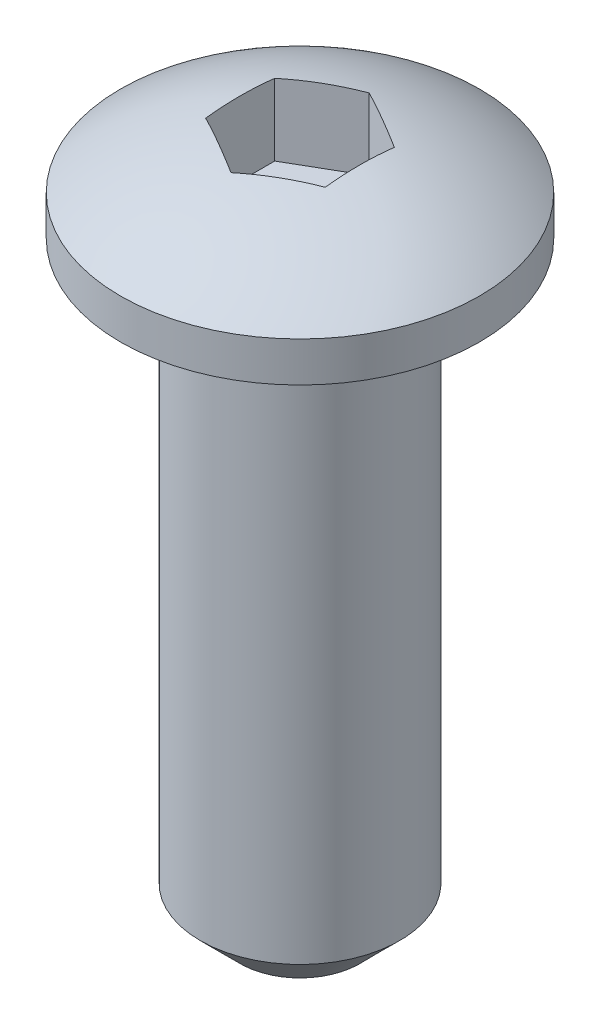
ISO-10303-21;
HEADER;
FILE_DESCRIPTION(('STEP AP214'),'2;1');
FILE_NAME('part.step','',(''),(''),'','','');
FILE_SCHEMA(('AUTOMOTIVE_DESIGN { 1 0 10303 214 1 1 1 1 }'));
ENDSEC;
DATA;
#1=APPLICATION_CONTEXT('core data for automotive mechanical design processes');
#2=APPLICATION_PROTOCOL_DEFINITION('international standard','automotive_design',2000,#1);
#3=PRODUCT_CONTEXT('',#1,'mechanical');
#4=PRODUCT('Part','Part','',(#3));
#5=PRODUCT_RELATED_PRODUCT_CATEGORY('part','',(#4));
#6=PRODUCT_DEFINITION_FORMATION('','',#4);
#7=PRODUCT_DEFINITION_CONTEXT('part definition',#1,'design');
#8=PRODUCT_DEFINITION('design','',#6,#7);
#9=PRODUCT_DEFINITION_SHAPE('','',#8);
#10=(LENGTH_UNIT() NAMED_UNIT(*) SI_UNIT(.MILLI.,.METRE.));
#11=(NAMED_UNIT(*) PLANE_ANGLE_UNIT() SI_UNIT($,.RADIAN.));
#12=(NAMED_UNIT(*) SI_UNIT($,.STERADIAN.) SOLID_ANGLE_UNIT());
#13=UNCERTAINTY_MEASURE_WITH_UNIT(LENGTH_MEASURE(1.E-05),#10,'distance_accuracy_value','');
#14=(GEOMETRIC_REPRESENTATION_CONTEXT(3) GLOBAL_UNCERTAINTY_ASSIGNED_CONTEXT((#13)) GLOBAL_UNIT_ASSIGNED_CONTEXT((#10,
#11,#12)) REPRESENTATION_CONTEXT('',''));
#15=CARTESIAN_POINT('',(0.,0.,0.));
#16=DIRECTION('',(0.,0.,1.));
#17=DIRECTION('',(1.,0.,0.));
#18=AXIS2_PLACEMENT_3D('',#15,#16,#17);
#19=CARTESIAN_POINT('',(0.,-5.,0.));
#20=DIRECTION('',(0.,1.,0.));
#21=DIRECTION('',(-1.,0.,0.));
#22=AXIS2_PLACEMENT_3D('',#19,#20,#21);
#23=SPHERICAL_SURFACE('',#22,7.5);
#24=CARTESIAN_POINT('',(0.,1.,0.));
#25=DIRECTION('',(0.,1.,0.));
#26=DIRECTION('',(0.,0.,1.));
#27=AXIS2_PLACEMENT_3D('',#24,#25,#26);
#28=CIRCLE('',#27,4.5);
#29=CARTESIAN_POINT('',(0.,1.,4.5));
#30=VERTEX_POINT('',#29);
#31=EDGE_CURVE('E128',#30,#30,#28,.T.);
#32=ORIENTED_EDGE('',*,*,#31,.T.);
#33=EDGE_LOOP('',(#32));
#34=FACE_BOUND('',#33,.T.);
#35=CARTESIAN_POINT('',(-0.749999999999999,-5.,-1.29903810567666));
#36=DIRECTION('',(0.5,0.,0.866025403784439));
#37=DIRECTION('',(0.866025403784439,0.,-0.5));
#38=AXIS2_PLACEMENT_3D('',#35,#36,#37);
#39=CIRCLE('',#38,7.34846922834954);
#40=CARTESIAN_POINT('',(-1.5,2.29725975966321,-0.866025403784439));
#41=VERTEX_POINT('',#40);
#42=CARTESIAN_POINT('',(0.,2.29725975966321,-1.73205080756888));
#43=VERTEX_POINT('',#42);
#44=EDGE_CURVE('E143',#41,#43,#39,.F.);
#45=ORIENTED_EDGE('',*,*,#44,.T.);
#46=CARTESIAN_POINT('',(0.750000000000002,-5.,-1.29903810567666));
#47=DIRECTION('',(-0.5,0.,0.866025403784438));
#48=DIRECTION('',(0.866025403784439,0.,0.5));
#49=AXIS2_PLACEMENT_3D('',#46,#47,#48);
#50=CIRCLE('',#49,7.34846922834954);
#51=CARTESIAN_POINT('',(1.5,2.29725975966321,-0.866025403784439));
#52=VERTEX_POINT('',#51);
#53=EDGE_CURVE('E54',#43,#52,#50,.F.);
#54=ORIENTED_EDGE('',*,*,#53,.T.);
#55=CARTESIAN_POINT('',(1.5,-5.,0.));
#56=DIRECTION('',(-1.,0.,0.));
#57=DIRECTION('',(0.,0.,1.));
#58=AXIS2_PLACEMENT_3D('',#55,#56,#57);
#59=CIRCLE('',#58,7.34846922834954);
#60=CARTESIAN_POINT('',(1.5,2.29725975966321,0.86602540378444));
#61=VERTEX_POINT('',#60);
#62=EDGE_CURVE('E131',#52,#61,#59,.F.);
#63=ORIENTED_EDGE('',*,*,#62,.T.);
#64=CARTESIAN_POINT('',(0.750000000000002,-5.,1.29903810567666));
#65=DIRECTION('',(-0.5,0.,-0.866025403784439));
#66=DIRECTION('',(-0.866025403784439,0.,0.5));
#67=AXIS2_PLACEMENT_3D('',#64,#65,#66);
#68=CIRCLE('',#67,7.34846922834954);
#69=CARTESIAN_POINT('',(0.,2.29725975966321,1.73205080756888));
#70=VERTEX_POINT('',#69);
#71=EDGE_CURVE('E134',#61,#70,#68,.F.);
#72=ORIENTED_EDGE('',*,*,#71,.T.);
#73=CARTESIAN_POINT('',(-0.749999999999998,-5.,1.29903810567666));
#74=DIRECTION('',(0.5,0.,-0.866025403784439));
#75=DIRECTION('',(-0.866025403784439,0.,-0.5));
#76=AXIS2_PLACEMENT_3D('',#73,#74,#75);
#77=CIRCLE('',#76,7.34846922834954);
#78=CARTESIAN_POINT('',(-1.5,2.29725975966321,0.866025403784438));
#79=VERTEX_POINT('',#78);
#80=EDGE_CURVE('E137',#70,#79,#77,.F.);
#81=ORIENTED_EDGE('',*,*,#80,.T.);
#82=CARTESIAN_POINT('',(-1.5,-5.,0.));
#83=DIRECTION('',(1.,0.,0.));
#84=DIRECTION('',(0.,0.,-1.));
#85=AXIS2_PLACEMENT_3D('',#82,#83,#84);
#86=CIRCLE('',#85,7.34846922834954);
#87=EDGE_CURVE('E140',#79,#41,#86,.F.);
#88=ORIENTED_EDGE('',*,*,#87,.T.);
#89=EDGE_LOOP('',(#45,#54,#63,#72,#81,#88));
#90=FACE_BOUND('',#89,.T.);
#91=ADVANCED_FACE('F31',(#34,#90),#23,.T.);
#92=CARTESIAN_POINT('',(0.,-15.,0.));
#93=DIRECTION('',(0.,-1.,0.));
#94=DIRECTION('',(0.,0.,-1.));
#95=AXIS2_PLACEMENT_3D('',#92,#93,#94);
#96=PLANE('',#95);
#97=CARTESIAN_POINT('',(0.,-15.,0.));
#98=DIRECTION('',(0.,-1.,0.));
#99=DIRECTION('',(0.,0.,-1.));
#100=AXIS2_PLACEMENT_3D('',#97,#98,#99);
#101=CIRCLE('',#100,1.49999999999999);
#102=CARTESIAN_POINT('',(0.,-15.,-1.49999999999999));
#103=VERTEX_POINT('',#102);
#104=EDGE_CURVE('E11',#103,#103,#101,.T.);
#105=ORIENTED_EDGE('',*,*,#104,.T.);
#106=EDGE_LOOP('',(#105));
#107=FACE_BOUND('',#106,.T.);
#108=ADVANCED_FACE('F33',(#107),#96,.T.);
#109=CARTESIAN_POINT('',(0.,16.1829805996473,0.));
#110=DIRECTION('',(0.,1.,0.));
#111=DIRECTION('',(0.,0.,1.));
#112=AXIS2_PLACEMENT_3D('',#109,#110,#111);
#113=CYLINDRICAL_SURFACE('',#112,4.5);
#114=CARTESIAN_POINT('',(0.,0.,0.));
#115=DIRECTION('',(0.,1.,0.));
#116=DIRECTION('',(0.,0.,1.));
#117=AXIS2_PLACEMENT_3D('',#114,#115,#116);
#118=CIRCLE('',#117,4.5);
#119=CARTESIAN_POINT('',(0.,0.,4.5));
#120=VERTEX_POINT('',#119);
#121=EDGE_CURVE('E125',#120,#120,#118,.T.);
#122=ORIENTED_EDGE('',*,*,#121,.T.);
#123=EDGE_LOOP('',(#122));
#124=FACE_BOUND('',#123,.T.);
#125=ORIENTED_EDGE('',*,*,#31,.F.);
#126=EDGE_LOOP('',(#125));
#127=FACE_BOUND('',#126,.T.);
#128=ADVANCED_FACE('F169',(#124,#127),#113,.T.);
#129=CARTESIAN_POINT('',(-2.5,0.,0.));
#130=DIRECTION('',(0.,-1.,0.));
#131=DIRECTION('',(0.,0.,-1.));
#132=AXIS2_PLACEMENT_3D('',#129,#130,#131);
#133=PLANE('',#132);
#134=CARTESIAN_POINT('',(0.,0.,0.));
#135=DIRECTION('',(0.,1.,0.));
#136=DIRECTION('',(0.,0.,1.));
#137=AXIS2_PLACEMENT_3D('',#134,#135,#136);
#138=CIRCLE('',#137,2.5);
#139=CARTESIAN_POINT('',(0.,0.,2.5));
#140=VERTEX_POINT('',#139);
#141=EDGE_CURVE('E90',#140,#140,#138,.T.);
#142=ORIENTED_EDGE('',*,*,#141,.T.);
#143=EDGE_LOOP('',(#142));
#144=FACE_BOUND('',#143,.T.);
#145=ORIENTED_EDGE('',*,*,#121,.F.);
#146=EDGE_LOOP('',(#145));
#147=FACE_BOUND('',#146,.T.);
#148=ADVANCED_FACE('F175',(#144,#147),#133,.T.);
#149=CARTESIAN_POINT('',(0.,16.1829805996473,0.));
#150=DIRECTION('',(0.,1.,0.));
#151=DIRECTION('',(0.,0.,1.));
#152=AXIS2_PLACEMENT_3D('',#149,#150,#151);
#153=CYLINDRICAL_SURFACE('',#152,2.5);
#154=CARTESIAN_POINT('',(0.,-14.,0.));
#155=DIRECTION('',(0.,-1.,0.));
#156=DIRECTION('',(0.,0.,-1.));
#157=AXIS2_PLACEMENT_3D('',#154,#155,#156);
#158=CIRCLE('',#157,2.5);
#159=CARTESIAN_POINT('',(0.,-14.,-2.5));
#160=VERTEX_POINT('',#159);
#161=EDGE_CURVE('E39',#160,#160,#158,.F.);
#162=ORIENTED_EDGE('',*,*,#161,.T.);
#163=EDGE_LOOP('',(#162));
#164=FACE_BOUND('',#163,.T.);
#165=ORIENTED_EDGE('',*,*,#141,.F.);
#166=EDGE_LOOP('',(#165));
#167=FACE_BOUND('',#166,.T.);
#168=ADVANCED_FACE('F148',(#164,#167),#153,.T.);
#169=CARTESIAN_POINT('',(1.5,2.5,-0.866025403784439));
#170=DIRECTION('',(-0.5,0.,0.866025403784438));
#171=DIRECTION('',(0.866025403784439,0.,0.5));
#172=AXIS2_PLACEMENT_3D('',#169,#170,#171);
#173=PLANE('',#172);
#174=DIRECTION('',(0.,-1.,0.));
#175=VECTOR('',#174,1.);
#176=CARTESIAN_POINT('',(0.,2.5,-1.73205080756888));
#177=LINE('',#176,#175);
#178=CARTESIAN_POINT('',(0.,0.5,-1.73205080756888));
#179=VERTEX_POINT('',#178);
#180=EDGE_CURVE('E83',#43,#179,#177,.T.);
#181=ORIENTED_EDGE('',*,*,#180,.T.);
#182=DIRECTION('',(-0.866025403784439,0.,-0.5));
#183=VECTOR('',#182,1.);
#184=CARTESIAN_POINT('',(1.5,0.5,-0.866025403784439));
#185=LINE('',#184,#183);
#186=CARTESIAN_POINT('',(1.5,0.5,-0.866025403784439));
#187=VERTEX_POINT('',#186);
#188=EDGE_CURVE('E87',#187,#179,#185,.T.);
#189=ORIENTED_EDGE('',*,*,#188,.F.);
#190=DIRECTION('',(0.,-1.,0.));
#191=VECTOR('',#190,1.);
#192=CARTESIAN_POINT('',(1.5,2.5,-0.866025403784439));
#193=LINE('',#192,#191);
#194=EDGE_CURVE('E115',#52,#187,#193,.T.);
#195=ORIENTED_EDGE('',*,*,#194,.F.);
#196=ORIENTED_EDGE('',*,*,#53,.F.);
#197=EDGE_LOOP('',(#181,#189,#195,#196));
#198=FACE_BOUND('',#197,.T.);
#199=ADVANCED_FACE('F85',(#198),#173,.T.);
#200=CARTESIAN_POINT('',(0.,2.5,-1.73205080756888));
#201=DIRECTION('',(0.5,0.,0.866025403784439));
#202=DIRECTION('',(0.866025403784439,0.,-0.5));
#203=AXIS2_PLACEMENT_3D('',#200,#201,#202);
#204=PLANE('',#203);
#205=DIRECTION('',(0.,-1.,0.));
#206=VECTOR('',#205,1.);
#207=CARTESIAN_POINT('',(-1.5,2.5,-0.866025403784439));
#208=LINE('',#207,#206);
#209=CARTESIAN_POINT('',(-1.5,0.5,-0.866025403784439));
#210=VERTEX_POINT('',#209);
#211=EDGE_CURVE('E91',#41,#210,#208,.T.);
#212=ORIENTED_EDGE('',*,*,#211,.T.);
#213=DIRECTION('',(-0.866025403784439,0.,0.5));
#214=VECTOR('',#213,1.);
#215=CARTESIAN_POINT('',(0.,0.5,-1.73205080756888));
#216=LINE('',#215,#214);
#217=EDGE_CURVE('E94',#179,#210,#216,.T.);
#218=ORIENTED_EDGE('',*,*,#217,.F.);
#219=ORIENTED_EDGE('',*,*,#180,.F.);
#220=ORIENTED_EDGE('',*,*,#44,.F.);
#221=EDGE_LOOP('',(#212,#218,#219,#220));
#222=FACE_BOUND('',#221,.T.);
#223=ADVANCED_FACE('F95',(#222),#204,.T.);
#224=CARTESIAN_POINT('',(-1.5,2.5,-0.866025403784439));
#225=DIRECTION('',(1.,0.,0.));
#226=DIRECTION('',(0.,0.,-1.));
#227=AXIS2_PLACEMENT_3D('',#224,#225,#226);
#228=PLANE('',#227);
#229=DIRECTION('',(0.,-1.,0.));
#230=VECTOR('',#229,1.);
#231=CARTESIAN_POINT('',(-1.5,2.5,0.866025403784438));
#232=LINE('',#231,#230);
#233=CARTESIAN_POINT('',(-1.5,0.5,0.866025403784438));
#234=VERTEX_POINT('',#233);
#235=EDGE_CURVE('E120',#79,#234,#232,.T.);
#236=ORIENTED_EDGE('',*,*,#235,.T.);
#237=DIRECTION('',(0.,0.,1.));
#238=VECTOR('',#237,1.);
#239=CARTESIAN_POINT('',(-1.5,0.5,-0.866025403784439));
#240=LINE('',#239,#238);
#241=EDGE_CURVE('E100',#210,#234,#240,.T.);
#242=ORIENTED_EDGE('',*,*,#241,.F.);
#243=ORIENTED_EDGE('',*,*,#211,.F.);
#244=ORIENTED_EDGE('',*,*,#87,.F.);
#245=EDGE_LOOP('',(#236,#242,#243,#244));
#246=FACE_BOUND('',#245,.T.);
#247=ADVANCED_FACE('F183',(#246),#228,.T.);
#248=CARTESIAN_POINT('',(-1.5,2.5,0.866025403784438));
#249=DIRECTION('',(0.5,0.,-0.866025403784439));
#250=DIRECTION('',(-0.866025403784439,0.,-0.5));
#251=AXIS2_PLACEMENT_3D('',#248,#249,#250);
#252=PLANE('',#251);
#253=DIRECTION('',(0.,-1.,0.));
#254=VECTOR('',#253,1.);
#255=CARTESIAN_POINT('',(0.,2.5,1.73205080756888));
#256=LINE('',#255,#254);
#257=CARTESIAN_POINT('',(0.,0.5,1.73205080756888));
#258=VERTEX_POINT('',#257);
#259=EDGE_CURVE('E118',#70,#258,#256,.T.);
#260=ORIENTED_EDGE('',*,*,#259,.T.);
#261=DIRECTION('',(0.866025403784439,0.,0.5));
#262=VECTOR('',#261,1.);
#263=CARTESIAN_POINT('',(-1.5,0.5,0.866025403784438));
#264=LINE('',#263,#262);
#265=EDGE_CURVE('E109',#234,#258,#264,.T.);
#266=ORIENTED_EDGE('',*,*,#265,.F.);
#267=ORIENTED_EDGE('',*,*,#235,.F.);
#268=ORIENTED_EDGE('',*,*,#80,.F.);
#269=EDGE_LOOP('',(#260,#266,#267,#268));
#270=FACE_BOUND('',#269,.T.);
#271=ADVANCED_FACE('F186',(#270),#252,.T.);
#272=CARTESIAN_POINT('',(0.,2.5,1.73205080756888));
#273=DIRECTION('',(-0.5,0.,-0.866025403784439));
#274=DIRECTION('',(-0.866025403784439,0.,0.5));
#275=AXIS2_PLACEMENT_3D('',#272,#273,#274);
#276=PLANE('',#275);
#277=DIRECTION('',(0.,-1.,0.));
#278=VECTOR('',#277,1.);
#279=CARTESIAN_POINT('',(1.5,2.5,0.86602540378444));
#280=LINE('',#279,#278);
#281=CARTESIAN_POINT('',(1.5,0.5,0.86602540378444));
#282=VERTEX_POINT('',#281);
#283=EDGE_CURVE('E46',#61,#282,#280,.T.);
#284=ORIENTED_EDGE('',*,*,#283,.T.);
#285=DIRECTION('',(0.866025403784439,0.,-0.5));
#286=VECTOR('',#285,1.);
#287=CARTESIAN_POINT('',(0.,0.5,1.73205080756888));
#288=LINE('',#287,#286);
#289=EDGE_CURVE('E112',#258,#282,#288,.T.);
#290=ORIENTED_EDGE('',*,*,#289,.F.);
#291=ORIENTED_EDGE('',*,*,#259,.F.);
#292=ORIENTED_EDGE('',*,*,#71,.F.);
#293=EDGE_LOOP('',(#284,#290,#291,#292));
#294=FACE_BOUND('',#293,.T.);
#295=ADVANCED_FACE('F190',(#294),#276,.T.);
#296=CARTESIAN_POINT('',(1.5,2.5,0.86602540378444));
#297=DIRECTION('',(-1.,0.,0.));
#298=DIRECTION('',(0.,0.,1.));
#299=AXIS2_PLACEMENT_3D('',#296,#297,#298);
#300=PLANE('',#299);
#301=ORIENTED_EDGE('',*,*,#194,.T.);
#302=DIRECTION('',(0.,0.,-1.));
#303=VECTOR('',#302,1.);
#304=CARTESIAN_POINT('',(1.5,0.5,0.86602540378444));
#305=LINE('',#304,#303);
#306=EDGE_CURVE('E105',#282,#187,#305,.T.);
#307=ORIENTED_EDGE('',*,*,#306,.F.);
#308=ORIENTED_EDGE('',*,*,#283,.F.);
#309=ORIENTED_EDGE('',*,*,#62,.F.);
#310=EDGE_LOOP('',(#301,#307,#308,#309));
#311=FACE_BOUND('',#310,.T.);
#312=ADVANCED_FACE('F159',(#311),#300,.T.);
#313=CARTESIAN_POINT('',(3.,0.5,0.));
#314=DIRECTION('',(0.,-1.,0.));
#315=DIRECTION('',(0.,0.,-1.));
#316=AXIS2_PLACEMENT_3D('',#313,#314,#315);
#317=PLANE('',#316);
#318=ORIENTED_EDGE('',*,*,#188,.T.);
#319=ORIENTED_EDGE('',*,*,#217,.T.);
#320=ORIENTED_EDGE('',*,*,#241,.T.);
#321=ORIENTED_EDGE('',*,*,#265,.T.);
#322=ORIENTED_EDGE('',*,*,#289,.T.);
#323=ORIENTED_EDGE('',*,*,#306,.T.);
#324=EDGE_LOOP('',(#318,#319,#320,#321,#322,#323));
#325=FACE_BOUND('',#324,.T.);
#326=ADVANCED_FACE('F103',(#325),#317,.F.);
#327=CARTESIAN_POINT('',(0.,-14.,0.));
#328=DIRECTION('',(0.,1.,0.));
#329=DIRECTION('',(0.,0.,1.));
#330=AXIS2_PLACEMENT_3D('',#327,#328,#329);
#331=CONICAL_SURFACE('',#330,2.5,0.785398163397451);
#332=ORIENTED_EDGE('',*,*,#104,.F.);
#333=EDGE_LOOP('',(#332));
#334=FACE_BOUND('',#333,.T.);
#335=ORIENTED_EDGE('',*,*,#161,.F.);
#336=EDGE_LOOP('',(#335));
#337=FACE_BOUND('',#336,.T.);
#338=ADVANCED_FACE('F151',(#334,#337),#331,.T.);
#339=CLOSED_SHELL('',(#91,#108,#128,#148,#168,#199,#223,#247,#271,#295,#312,#326,#338));
#340=MANIFOLD_SOLID_BREP('B2',#339);
#341=ADVANCED_BREP_SHAPE_REPRESENTATION('',(#18,#340),#14);
#342=SHAPE_DEFINITION_REPRESENTATION(#9,#341);
ENDSEC;
END-ISO-10303-21;
